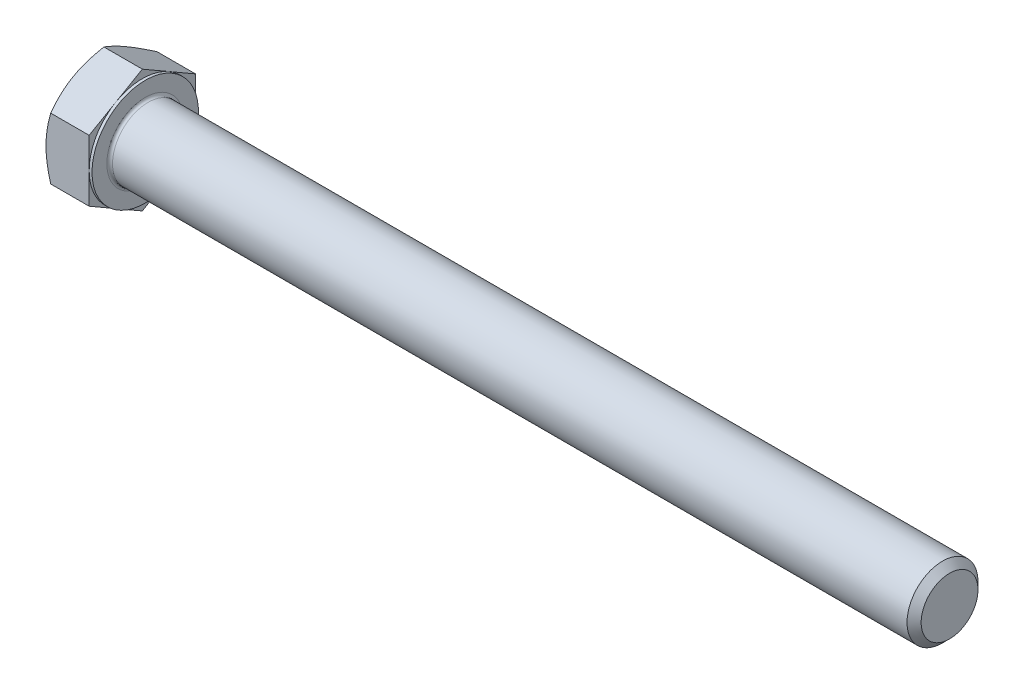
ISO-10303-21;
HEADER;
FILE_DESCRIPTION(('STEP AP214'),'2;1');
FILE_NAME('part.step','',(''),(''),'','','');
FILE_SCHEMA(('AUTOMOTIVE_DESIGN { 1 0 10303 214 1 1 1 1 }'));
ENDSEC;
DATA;
#1=APPLICATION_CONTEXT('core data for automotive mechanical design processes');
#2=APPLICATION_PROTOCOL_DEFINITION('international standard','automotive_design',2000,#1);
#3=PRODUCT_CONTEXT('',#1,'mechanical');
#4=PRODUCT('Part','Part','',(#3));
#5=PRODUCT_RELATED_PRODUCT_CATEGORY('part','',(#4));
#6=PRODUCT_DEFINITION_FORMATION('','',#4);
#7=PRODUCT_DEFINITION_CONTEXT('part definition',#1,'design');
#8=PRODUCT_DEFINITION('design','',#6,#7);
#9=PRODUCT_DEFINITION_SHAPE('','',#8);
#10=(LENGTH_UNIT() NAMED_UNIT(*) SI_UNIT(.MILLI.,.METRE.));
#11=(NAMED_UNIT(*) PLANE_ANGLE_UNIT() SI_UNIT($,.RADIAN.));
#12=(NAMED_UNIT(*) SI_UNIT($,.STERADIAN.) SOLID_ANGLE_UNIT());
#13=UNCERTAINTY_MEASURE_WITH_UNIT(LENGTH_MEASURE(1.E-05),#10,'distance_accuracy_value','');
#14=(GEOMETRIC_REPRESENTATION_CONTEXT(3) GLOBAL_UNCERTAINTY_ASSIGNED_CONTEXT((#13)) GLOBAL_UNIT_ASSIGNED_CONTEXT((#10,
#11,#12)) REPRESENTATION_CONTEXT('',''));
#15=CARTESIAN_POINT('',(0.,0.,0.));
#16=DIRECTION('',(0.,0.,1.));
#17=DIRECTION('',(1.,0.,0.));
#18=AXIS2_PLACEMENT_3D('',#15,#16,#17);
#19=CARTESIAN_POINT('',(0.,8.24155962262808,0.));
#20=DIRECTION('',(1.,0.,0.));
#21=DIRECTION('',(0.,0.,-1.));
#22=AXIS2_PLACEMENT_3D('',#19,#20,#21);
#23=PLANE('',#22);
#24=CARTESIAN_POINT('',(0.,0.,0.));
#25=DIRECTION('',(1.,0.,0.));
#26=DIRECTION('',(0.,0.,-1.));
#27=AXIS2_PLACEMENT_3D('',#24,#25,#26);
#28=CIRCLE('',#27,7.1374);
#29=CARTESIAN_POINT('',(0.,-6.18116971697105,-3.56870000000001));
#30=VERTEX_POINT('',#29);
#31=CARTESIAN_POINT('',(0.,0.,-7.1374));
#32=VERTEX_POINT('',#31);
#33=EDGE_CURVE('E141',#30,#32,#28,.T.);
#34=ORIENTED_EDGE('',*,*,#33,.F.);
#35=CARTESIAN_POINT('',(0.,0.,0.));
#36=DIRECTION('',(1.,0.,0.));
#37=DIRECTION('',(0.,0.,-1.));
#38=AXIS2_PLACEMENT_3D('',#35,#36,#37);
#39=CIRCLE('',#38,7.1374);
#40=CARTESIAN_POINT('',(0.,-6.18116971697106,3.56870000000001));
#41=VERTEX_POINT('',#40);
#42=EDGE_CURVE('E138',#41,#30,#39,.T.);
#43=ORIENTED_EDGE('',*,*,#42,.F.);
#44=CARTESIAN_POINT('',(0.,0.,0.));
#45=DIRECTION('',(1.,0.,0.));
#46=DIRECTION('',(0.,0.,-1.));
#47=AXIS2_PLACEMENT_3D('',#44,#45,#46);
#48=CIRCLE('',#47,7.1374);
#49=CARTESIAN_POINT('',(0.,0.,7.1374));
#50=VERTEX_POINT('',#49);
#51=EDGE_CURVE('E492',#50,#41,#48,.T.);
#52=ORIENTED_EDGE('',*,*,#51,.F.);
#53=CARTESIAN_POINT('',(0.,0.,0.));
#54=DIRECTION('',(1.,0.,0.));
#55=DIRECTION('',(0.,0.,-1.));
#56=AXIS2_PLACEMENT_3D('',#53,#54,#55);
#57=CIRCLE('',#56,7.1374);
#58=CARTESIAN_POINT('',(0.,6.18116971697105,3.56870000000001));
#59=VERTEX_POINT('',#58);
#60=EDGE_CURVE('E207',#59,#50,#57,.T.);
#61=ORIENTED_EDGE('',*,*,#60,.F.);
#62=CARTESIAN_POINT('',(0.,0.,0.));
#63=DIRECTION('',(1.,0.,0.));
#64=DIRECTION('',(0.,0.,-1.));
#65=AXIS2_PLACEMENT_3D('',#62,#63,#64);
#66=CIRCLE('',#65,7.1374);
#67=CARTESIAN_POINT('',(0.,6.18116971697105,-3.56870000000001));
#68=VERTEX_POINT('',#67);
#69=EDGE_CURVE('E498',#68,#59,#66,.T.);
#70=ORIENTED_EDGE('',*,*,#69,.F.);
#71=CARTESIAN_POINT('',(0.,0.,0.));
#72=DIRECTION('',(1.,0.,0.));
#73=DIRECTION('',(0.,0.,-1.));
#74=AXIS2_PLACEMENT_3D('',#71,#72,#73);
#75=CIRCLE('',#74,7.1374);
#76=EDGE_CURVE('E144',#32,#68,#75,.T.);
#77=ORIENTED_EDGE('',*,*,#76,.F.);
#78=EDGE_LOOP('',(#34,#43,#52,#61,#70,#77));
#79=FACE_BOUND('',#78,.T.);
#80=ADVANCED_FACE('F16',(#79),#23,.F.);
#81=CARTESIAN_POINT('',(0.641311776484754,0.,0.));
#82=DIRECTION('',(1.,0.,0.));
#83=DIRECTION('',(0.,0.,-1.));
#84=AXIS2_PLACEMENT_3D('',#81,#82,#83);
#85=CONICAL_SURFACE('',#84,8.24818458036387,1.0471975511966);
#86=ORIENTED_EDGE('',*,*,#42,.T.);
#87=CARTESIAN_POINT('',(0.,-6.18116971697106,-3.56870000000002));
#88=CARTESIAN_POINT('',(-2.91702878281906E-05,-6.26862170985652,-3.41722870509925));
#89=CARTESIAN_POINT('',(0.00371114889844038,-6.35606948988297,-3.26576470708432));
#90=CARTESIAN_POINT('',(0.0185139577467835,-6.53079334497843,-2.9631341127647));
#91=CARTESIAN_POINT('',(0.0295749978503088,-6.61806945060963,-2.81196746352471));
#92=CARTESIAN_POINT('',(0.0587296036169501,-6.7918862225359,-2.5109079833408));
#93=CARTESIAN_POINT('',(0.0767877659737066,-6.87842838481195,-2.3610125612818));
#94=CARTESIAN_POINT('',(0.119548178265526,-7.05110039256495,-2.06193587080869));
#95=CARTESIAN_POINT('',(0.144250603082628,-7.13723022712836,-1.91275462129736));
#96=CARTESIAN_POINT('',(0.227561148311189,-7.39464422393007,-1.46690050025742));
#97=CARTESIAN_POINT('',(0.295412992760169,-7.56518058886256,-1.17152285165624));
#98=CARTESIAN_POINT('',(0.451896700790797,-7.90478678087675,-0.583307672522674));
#99=CARTESIAN_POINT('',(0.540632343376944,-8.07384476218822,-0.290490659466179));
#100=CARTESIAN_POINT('',(0.637486855352638,-8.2415596226281,0.));
#101=B_SPLINE_CURVE_WITH_KNOTS('',3,(#87,#88,#89,#90,#91,#92,#93,#94,#95,#96,#97,#98,#99,#100),
.UNSPECIFIED.,.F.,.F.,(4,2,2,2,2,2,4),(0.,0.524658409500519,1.04921296370403,1.5711473776056,
2.09309553056225,3.13562382142666,4.18344647054619),.UNSPECIFIED.);
#102=CARTESIAN_POINT('',(0.637486855352637,-8.2415596226281,0.));
#103=VERTEX_POINT('',#102);
#104=EDGE_CURVE('E158',#30,#103,#101,.T.);
#105=ORIENTED_EDGE('',*,*,#104,.T.);
#106=CARTESIAN_POINT('',(0.637486855352637,-8.2415596226281,0.));
#107=CARTESIAN_POINT('',(0.540632343376944,-8.07384476218822,0.290490659466181));
#108=CARTESIAN_POINT('',(0.451896700790797,-7.90478678087675,0.583307672522676));
#109=CARTESIAN_POINT('',(0.295412992760169,-7.56518058886257,1.17152285165624));
#110=CARTESIAN_POINT('',(0.227561148311189,-7.39464422393008,1.46690050025742));
#111=CARTESIAN_POINT('',(0.14425060308263,-7.13723022712836,1.91275462129736));
#112=CARTESIAN_POINT('',(0.119548178265528,-7.05110039256495,2.06193587080869));
#113=CARTESIAN_POINT('',(0.0767877659737086,-6.87842838481196,2.3610125612818));
#114=CARTESIAN_POINT('',(0.0587296036169518,-6.7918862225359,2.5109079833408));
#115=CARTESIAN_POINT('',(0.0295749978503104,-6.61806945060963,2.81196746352471));
#116=CARTESIAN_POINT('',(0.0185139577467855,-6.53079334497843,2.9631341127647));
#117=CARTESIAN_POINT('',(0.00371114889844278,-6.35606948988298,3.26576470708432));
#118=CARTESIAN_POINT('',(-2.91702878256121E-05,-6.26862170985652,3.41722870509925));
#119=CARTESIAN_POINT('',(0.,-6.18116971697107,3.56870000000002));
#120=B_SPLINE_CURVE_WITH_KNOTS('',3,(#106,#107,#108,#109,#110,#111,#112,#113,#114,#115,#116,
#117,#118,#119),.UNSPECIFIED.,.F.,.F.,(4,2,2,2,2,2,4),(0.,1.04782264911953,2.09035093998394,
2.61229909294058,3.13423350684215,3.65878806104566,4.18344647054618),.UNSPECIFIED.);
#121=EDGE_CURVE('E164',#103,#41,#120,.T.);
#122=ORIENTED_EDGE('',*,*,#121,.T.);
#123=EDGE_LOOP('',(#86,#105,#122));
#124=FACE_BOUND('',#123,.T.);
#125=ADVANCED_FACE('F162',(#124),#85,.T.);
#126=CARTESIAN_POINT('',(0.641311776484743,0.,0.));
#127=DIRECTION('',(1.,0.,0.));
#128=DIRECTION('',(0.,0.,-1.));
#129=AXIS2_PLACEMENT_3D('',#126,#127,#128);
#130=CONICAL_SURFACE('',#129,8.24818458036385,1.0471975511966);
#131=ORIENTED_EDGE('',*,*,#33,.T.);
#132=CARTESIAN_POINT('',(0.,0.,-7.1374));
#133=CARTESIAN_POINT('',(-2.91702878363875E-05,-0.174903985770917,-7.1374));
#134=CARTESIAN_POINT('',(0.0037111488984321,-0.349799545823828,-7.1374));
#135=CARTESIAN_POINT('',(0.0185139577467752,-0.699247256014727,-7.1374));
#136=CARTESIAN_POINT('',(0.0295749978503004,-0.873799467277128,-7.1374));
#137=CARTESIAN_POINT('',(0.0587296036169417,-1.22143301112966,-7.1374));
#138=CARTESIAN_POINT('',(0.0767877659736981,-1.39451733568178,-7.1374));
#139=CARTESIAN_POINT('',(0.119548178265518,-1.73986135118776,-7.1374));
#140=CARTESIAN_POINT('',(0.144250603082619,-1.91212102031459,-7.1374));
#141=CARTESIAN_POINT('',(0.227561148311179,-2.42694901391801,-7.1374));
#142=CARTESIAN_POINT('',(0.295412992760159,-2.76802174378299,-7.1374));
#143=CARTESIAN_POINT('',(0.451896700790786,-3.44723412781136,-7.1374));
#144=CARTESIAN_POINT('',(0.540632343376933,-3.7853500904343,-7.1374));
#145=CARTESIAN_POINT('',(0.637486855352627,-4.12077981131404,-7.1374));
#146=B_SPLINE_CURVE_WITH_KNOTS('',3,(#132,#133,#134,#135,#136,#137,#138,#139,#140,#141,#142,
#143,#144,#145),.UNSPECIFIED.,.F.,.F.,(4,2,2,2,2,2,4),(0.,0.524658409500517,1.04921296370403,
1.5711473776056,2.09309553056224,3.13562382142665,4.18344647054617),.UNSPECIFIED.);
#147=CARTESIAN_POINT('',(0.637486855352626,-4.12077981131404,-7.1374));
#148=VERTEX_POINT('',#147);
#149=EDGE_CURVE('E153',#32,#148,#146,.T.);
#150=ORIENTED_EDGE('',*,*,#149,.T.);
#151=CARTESIAN_POINT('',(0.637486855352626,-4.12077981131404,-7.1374));
#152=CARTESIAN_POINT('',(0.540632343376933,-4.28849467175391,-6.84690934053382));
#153=CARTESIAN_POINT('',(0.451896700790788,-4.45755265306538,-6.55409232747733));
#154=CARTESIAN_POINT('',(0.295412992760162,-4.79715884507957,-5.96587714834377));
#155=CARTESIAN_POINT('',(0.227561148311183,-4.96769521001206,-5.6704994997426));
#156=CARTESIAN_POINT('',(0.144250603082625,-5.22510920681377,-5.22464537870266));
#157=CARTESIAN_POINT('',(0.119548178265524,-5.31123904137718,-5.07546412919133));
#158=CARTESIAN_POINT('',(0.076787765973705,-5.48391104913017,-4.77638743871822));
#159=CARTESIAN_POINT('',(0.0587296036169484,-5.57045321140623,-4.62649201665922));
#160=CARTESIAN_POINT('',(0.0295749978503076,-5.7442699833325,-4.32543253647532));
#161=CARTESIAN_POINT('',(0.0185139577467831,-5.8315460889637,-4.17426588723533));
#162=CARTESIAN_POINT('',(0.00371114889844091,-6.00626994405915,-3.87163529291571));
#163=CARTESIAN_POINT('',(-2.91702878274496E-05,-6.0937177240856,-3.72017129490078));
#164=CARTESIAN_POINT('',(0.,-6.18116971697106,-3.56870000000002));
#165=B_SPLINE_CURVE_WITH_KNOTS('',3,(#151,#152,#153,#154,#155,#156,#157,#158,#159,#160,#161,
#162,#163,#164),.UNSPECIFIED.,.F.,.F.,(4,2,2,2,2,2,4),(0.,1.04782264911952,2.09035093998392,
2.61229909294056,3.13423350684212,3.65878806104563,4.18344647054614),.UNSPECIFIED.);
#166=EDGE_CURVE('E151',#148,#30,#165,.T.);
#167=ORIENTED_EDGE('',*,*,#166,.T.);
#168=EDGE_LOOP('',(#131,#150,#167));
#169=FACE_BOUND('',#168,.T.);
#170=ADVANCED_FACE('F152',(#169),#130,.T.);
#171=CARTESIAN_POINT('',(0.641311776484739,0.,0.));
#172=DIRECTION('',(1.,0.,0.));
#173=DIRECTION('',(0.,0.,-1.));
#174=AXIS2_PLACEMENT_3D('',#171,#172,#173);
#175=CONICAL_SURFACE('',#174,8.24818458036384,1.0471975511966);
#176=CARTESIAN_POINT('',(0.637486855352624,4.12077981131404,-7.1374));
#177=CARTESIAN_POINT('',(0.540632343376931,3.78535009043429,-7.1374));
#178=CARTESIAN_POINT('',(0.451896700790785,3.44723412781136,-7.1374));
#179=CARTESIAN_POINT('',(0.295412992760157,2.76802174378299,-7.1374));
#180=CARTESIAN_POINT('',(0.227561148311177,2.42694901391801,-7.1374));
#181=CARTESIAN_POINT('',(0.144250603082619,1.91212102031458,-7.1374));
#182=CARTESIAN_POINT('',(0.119548178265517,1.73986135118776,-7.1374));
#183=CARTESIAN_POINT('',(0.076787765973698,1.39451733568178,-7.1374));
#184=CARTESIAN_POINT('',(0.0587296036169412,1.22143301112966,-7.1374));
#185=CARTESIAN_POINT('',(0.0295749978502998,0.873799467277126,-7.1374));
#186=CARTESIAN_POINT('',(0.018513957746775,0.699247256014726,-7.1374));
#187=CARTESIAN_POINT('',(0.0037111488984325,0.349799545823827,-7.1374));
#188=CARTESIAN_POINT('',(-2.91702878357943E-05,0.174903985770916,-7.1374));
#189=CARTESIAN_POINT('',(0.,0.,-7.1374));
#190=B_SPLINE_CURVE_WITH_KNOTS('',3,(#176,#177,#178,#179,#180,#181,#182,#183,#184,#185,#186,
#187,#188,#189),.UNSPECIFIED.,.F.,.F.,(4,2,2,2,2,2,4),(0.,1.04782264911952,2.09035093998393,
2.61229909294057,3.13423350684214,3.65878806104565,4.18344647054616),.UNSPECIFIED.);
#191=CARTESIAN_POINT('',(0.637486855352624,4.12077981131404,-7.1374));
#192=VERTEX_POINT('',#191);
#193=EDGE_CURVE('E177',#192,#32,#190,.T.);
#194=ORIENTED_EDGE('',*,*,#193,.T.);
#195=ORIENTED_EDGE('',*,*,#76,.T.);
#196=CARTESIAN_POINT('',(0.,6.18116971697105,-3.56870000000001));
#197=CARTESIAN_POINT('',(-2.9170287832926E-05,6.0937177240856,-3.72017129490077));
#198=CARTESIAN_POINT('',(0.00371114889843545,6.00626994405914,-3.8716352929157));
#199=CARTESIAN_POINT('',(0.018513957746778,5.83154608896369,-4.17426588723532));
#200=CARTESIAN_POINT('',(0.0295749978503029,5.74426998333249,-4.32543253647531));
#201=CARTESIAN_POINT('',(0.0587296036169437,5.57045321140622,-4.62649201665922));
#202=CARTESIAN_POINT('',(0.0767877659737001,5.48391104913017,-4.77638743871822));
#203=CARTESIAN_POINT('',(0.119548178265519,5.31123904137718,-5.07546412919132));
#204=CARTESIAN_POINT('',(0.144250603082621,5.22510920681376,-5.22464537870265));
#205=CARTESIAN_POINT('',(0.22756114831118,4.96769521001205,-5.67049949974259));
#206=CARTESIAN_POINT('',(0.295412992760159,4.79715884507956,-5.96587714834377));
#207=CARTESIAN_POINT('',(0.451896700790785,4.45755265306538,-6.55409232747733));
#208=CARTESIAN_POINT('',(0.540632343376931,4.28849467175391,-6.84690934053382));
#209=CARTESIAN_POINT('',(0.637486855352624,4.12077981131404,-7.1374));
#210=B_SPLINE_CURVE_WITH_KNOTS('',3,(#196,#197,#198,#199,#200,#201,#202,#203,#204,#205,#206,
#207,#208,#209),.UNSPECIFIED.,.F.,.F.,(4,2,2,2,2,2,4),(0.,0.524658409500515,1.04921296370402,
1.57114737760559,2.09309553056223,3.13562382142663,4.18344647054615),.UNSPECIFIED.);
#211=EDGE_CURVE('E287',#68,#192,#210,.T.);
#212=ORIENTED_EDGE('',*,*,#211,.T.);
#213=EDGE_LOOP('',(#194,#195,#212));
#214=FACE_BOUND('',#213,.T.);
#215=ADVANCED_FACE('F276',(#214),#175,.T.);
#216=CARTESIAN_POINT('',(0.641311776484745,0.,0.));
#217=DIRECTION('',(1.,0.,0.));
#218=DIRECTION('',(0.,0.,-1.));
#219=AXIS2_PLACEMENT_3D('',#216,#217,#218);
#220=CONICAL_SURFACE('',#219,8.24818458036385,1.0471975511966);
#221=CARTESIAN_POINT('',(0.637486855352629,8.24155962262808,0.));
#222=CARTESIAN_POINT('',(0.540632343376936,8.07384476218821,-0.290490659466181));
#223=CARTESIAN_POINT('',(0.45189670079079,7.90478678087674,-0.583307672522675));
#224=CARTESIAN_POINT('',(0.295412992760162,7.56518058886255,-1.17152285165624));
#225=CARTESIAN_POINT('',(0.227561148311182,7.39464422393006,-1.46690050025742));
#226=CARTESIAN_POINT('',(0.144250603082622,7.13723022712835,-1.91275462129736));
#227=CARTESIAN_POINT('',(0.119548178265521,7.05110039256494,-2.06193587080869));
#228=CARTESIAN_POINT('',(0.076787765973701,6.87842838481194,-2.3610125612818));
#229=CARTESIAN_POINT('',(0.0587296036169442,6.79188622253589,-2.5109079833408));
#230=CARTESIAN_POINT('',(0.0295749978503029,6.61806945060962,-2.81196746352471));
#231=CARTESIAN_POINT('',(0.018513957746778,6.53079334497842,-2.96313411276469));
#232=CARTESIAN_POINT('',(0.00371114889843529,6.35606948988297,-3.26576470708432));
#233=CARTESIAN_POINT('',(-2.91702878331806E-05,6.26862170985651,-3.41722870509924));
#234=CARTESIAN_POINT('',(0.,6.18116971697105,-3.56870000000001));
#235=B_SPLINE_CURVE_WITH_KNOTS('',3,(#221,#222,#223,#224,#225,#226,#227,#228,#229,#230,#231,
#232,#233,#234),.UNSPECIFIED.,.F.,.F.,(4,2,2,2,2,2,4),(0.,1.04782264911952,2.09035093998393,
2.61229909294058,3.13423350684215,3.65878806104566,4.18344647054617),.UNSPECIFIED.);
#236=CARTESIAN_POINT('',(0.637486855352629,8.24155962262808,0.));
#237=VERTEX_POINT('',#236);
#238=EDGE_CURVE('E281',#237,#68,#235,.T.);
#239=ORIENTED_EDGE('',*,*,#238,.T.);
#240=ORIENTED_EDGE('',*,*,#69,.T.);
#241=CARTESIAN_POINT('',(0.,6.18116971697105,3.56870000000001));
#242=CARTESIAN_POINT('',(-2.9170287834756E-05,6.26862170985651,3.41722870509925));
#243=CARTESIAN_POINT('',(0.00371114889843365,6.35606948988296,3.26576470708432));
#244=CARTESIAN_POINT('',(0.018513957746776,6.53079334497841,2.9631341127647));
#245=CARTESIAN_POINT('',(0.0295749978503007,6.61806945060961,2.81196746352471));
#246=CARTESIAN_POINT('',(0.0587296036169419,6.79188622253588,2.5109079833408));
#247=CARTESIAN_POINT('',(0.0767877659736988,6.87842838481194,2.3610125612818));
#248=CARTESIAN_POINT('',(0.119548178265519,7.05110039256493,2.06193587080869));
#249=CARTESIAN_POINT('',(0.14425060308262,7.13723022712835,1.91275462129736));
#250=CARTESIAN_POINT('',(0.22756114831118,7.39464422393006,1.46690050025742));
#251=CARTESIAN_POINT('',(0.295412992760161,7.56518058886255,1.17152285165624));
#252=CARTESIAN_POINT('',(0.451896700790789,7.90478678087674,0.583307672522675));
#253=CARTESIAN_POINT('',(0.540632343376935,8.07384476218821,0.29049065946618));
#254=CARTESIAN_POINT('',(0.637486855352629,8.24155962262808,0.));
#255=B_SPLINE_CURVE_WITH_KNOTS('',3,(#241,#242,#243,#244,#245,#246,#247,#248,#249,#250,#251,
#252,#253,#254),.UNSPECIFIED.,.F.,.F.,(4,2,2,2,2,2,4),(0.,0.524658409500518,1.04921296370403,
1.5711473776056,2.09309553056224,3.13562382142665,4.18344647054618),.UNSPECIFIED.);
#256=EDGE_CURVE('E267',#59,#237,#255,.T.);
#257=ORIENTED_EDGE('',*,*,#256,.T.);
#258=EDGE_LOOP('',(#239,#240,#257));
#259=FACE_BOUND('',#258,.T.);
#260=ADVANCED_FACE('F273',(#259),#220,.T.);
#261=CARTESIAN_POINT('',(0.641311776484745,0.,0.));
#262=DIRECTION('',(1.,0.,0.));
#263=DIRECTION('',(0.,0.,-1.));
#264=AXIS2_PLACEMENT_3D('',#261,#262,#263);
#265=CONICAL_SURFACE('',#264,8.24818458036385,1.0471975511966);
#266=ORIENTED_EDGE('',*,*,#51,.T.);
#267=CARTESIAN_POINT('',(0.,-6.18116971697107,3.56870000000002));
#268=CARTESIAN_POINT('',(-2.9170287825595E-05,-6.09371772408561,3.72017129490078));
#269=CARTESIAN_POINT('',(0.00371114889844298,-6.00626994405915,3.87163529291571));
#270=CARTESIAN_POINT('',(0.0185139577467859,-5.8315460889637,4.17426588723533));
#271=CARTESIAN_POINT('',(0.0295749978503109,-5.7442699833325,4.32543253647531));
#272=CARTESIAN_POINT('',(0.0587296036169516,-5.57045321140624,4.62649201665922));
#273=CARTESIAN_POINT('',(0.0767877659737078,-5.48391104913018,4.77638743871822));
#274=CARTESIAN_POINT('',(0.119548178265527,-5.31123904137719,5.07546412919133));
#275=CARTESIAN_POINT('',(0.144250603082628,-5.22510920681378,5.22464537870266));
#276=CARTESIAN_POINT('',(0.227561148311187,-4.96769521001206,5.6704994997426));
#277=CARTESIAN_POINT('',(0.295412992760166,-4.79715884507958,5.96587714834377));
#278=CARTESIAN_POINT('',(0.451896700790791,-4.45755265306539,6.55409232747733));
#279=CARTESIAN_POINT('',(0.540632343376936,-4.28849467175392,6.84690934053382));
#280=CARTESIAN_POINT('',(0.637486855352629,-4.12077981131405,7.1374));
#281=B_SPLINE_CURVE_WITH_KNOTS('',3,(#267,#268,#269,#270,#271,#272,#273,#274,#275,#276,#277,
#278,#279,#280),.UNSPECIFIED.,.F.,.F.,(4,2,2,2,2,2,4),(0.,0.524658409500513,1.04921296370402,
1.57114737760559,2.09309553056223,3.13562382142663,4.18344647054615),.UNSPECIFIED.);
#282=CARTESIAN_POINT('',(0.637486855352629,-4.12077981131405,7.1374));
#283=VERTEX_POINT('',#282);
#284=EDGE_CURVE('E159',#41,#283,#281,.T.);
#285=ORIENTED_EDGE('',*,*,#284,.T.);
#286=CARTESIAN_POINT('',(0.637486855352629,-4.12077981131405,7.1374));
#287=CARTESIAN_POINT('',(0.540632343376935,-3.78535009043431,7.1374));
#288=CARTESIAN_POINT('',(0.451896700790788,-3.44723412781137,7.1374));
#289=CARTESIAN_POINT('',(0.29541299276016,-2.768021743783,7.1374));
#290=CARTESIAN_POINT('',(0.22756114831118,-2.42694901391802,7.1374));
#291=CARTESIAN_POINT('',(0.14425060308262,-1.91212102031459,7.1374));
#292=CARTESIAN_POINT('',(0.119548178265519,-1.73986135118776,7.1374));
#293=CARTESIAN_POINT('',(0.0767877659736989,-1.39451733568178,7.1374));
#294=CARTESIAN_POINT('',(0.0587296036169421,-1.22143301112967,7.1374));
#295=CARTESIAN_POINT('',(0.0295749978503008,-0.87379946727713,7.1374));
#296=CARTESIAN_POINT('',(0.018513957746776,-0.699247256014728,7.1374));
#297=CARTESIAN_POINT('',(0.00371114889843334,-0.349799545823828,7.1374));
#298=CARTESIAN_POINT('',(-2.91702878350887E-05,-0.174903985770916,7.1374));
#299=CARTESIAN_POINT('',(0.,0.,7.1374));
#300=B_SPLINE_CURVE_WITH_KNOTS('',3,(#286,#287,#288,#289,#290,#291,#292,#293,#294,#295,#296,
#297,#298,#299),.UNSPECIFIED.,.F.,.F.,(4,2,2,2,2,2,4),(0.,1.04782264911953,2.09035093998394,
2.61229909294058,3.13423350684215,3.65878806104566,4.18344647054618),.UNSPECIFIED.);
#301=EDGE_CURVE('E245',#283,#50,#300,.T.);
#302=ORIENTED_EDGE('',*,*,#301,.T.);
#303=EDGE_LOOP('',(#266,#285,#302));
#304=FACE_BOUND('',#303,.T.);
#305=ADVANCED_FACE('F222',(#304),#265,.T.);
#306=CARTESIAN_POINT('',(0.641311776484738,0.,0.));
#307=DIRECTION('',(1.,0.,0.));
#308=DIRECTION('',(0.,0.,-1.));
#309=AXIS2_PLACEMENT_3D('',#306,#307,#308);
#310=CONICAL_SURFACE('',#309,8.24818458036384,1.0471975511966);
#311=CARTESIAN_POINT('',(0.637486855352622,4.12077981131403,7.1374));
#312=CARTESIAN_POINT('',(0.540632343376929,4.2884946717539,6.84690934053382));
#313=CARTESIAN_POINT('',(0.451896700790783,4.45755265306537,6.55409232747733));
#314=CARTESIAN_POINT('',(0.295412992760157,4.79715884507955,5.96587714834377));
#315=CARTESIAN_POINT('',(0.227561148311178,4.96769521001204,5.67049949974259));
#316=CARTESIAN_POINT('',(0.144250603082619,5.22510920681376,5.22464537870266));
#317=CARTESIAN_POINT('',(0.119548178265518,5.31123904137717,5.07546412919132));
#318=CARTESIAN_POINT('',(0.0767877659736985,5.48391104913016,4.77638743871822));
#319=CARTESIAN_POINT('',(0.0587296036169418,5.57045321140622,4.62649201665922));
#320=CARTESIAN_POINT('',(0.0295749978503007,5.74426998333248,4.32543253647531));
#321=CARTESIAN_POINT('',(0.0185139577467759,5.83154608896368,4.17426588723532));
#322=CARTESIAN_POINT('',(0.00371114889843337,6.00626994405913,3.8716352929157));
#323=CARTESIAN_POINT('',(-2.91702878350612E-05,6.09371772408559,3.72017129490078));
#324=CARTESIAN_POINT('',(0.,6.18116971697105,3.56870000000001));
#325=B_SPLINE_CURVE_WITH_KNOTS('',3,(#311,#312,#313,#314,#315,#316,#317,#318,#319,#320,#321,
#322,#323,#324),.UNSPECIFIED.,.F.,.F.,(4,2,2,2,2,2,4),(0.,1.04782264911952,2.09035093998392,
2.61229909294056,3.13423350684213,3.65878806104564,4.18344647054615),.UNSPECIFIED.);
#326=CARTESIAN_POINT('',(0.637486855352622,4.12077981131403,7.1374));
#327=VERTEX_POINT('',#326);
#328=EDGE_CURVE('E228',#327,#59,#325,.T.);
#329=ORIENTED_EDGE('',*,*,#328,.T.);
#330=ORIENTED_EDGE('',*,*,#60,.T.);
#331=CARTESIAN_POINT('',(0.,0.,7.1374));
#332=CARTESIAN_POINT('',(-2.91702878350349E-05,0.174903985770917,7.1374));
#333=CARTESIAN_POINT('',(0.00371114889843339,0.349799545823827,7.1374));
#334=CARTESIAN_POINT('',(0.0185139577467758,0.699247256014725,7.1374));
#335=CARTESIAN_POINT('',(0.0295749978503005,0.873799467277125,7.1374));
#336=CARTESIAN_POINT('',(0.0587296036169414,1.22143301112966,7.1374));
#337=CARTESIAN_POINT('',(0.076787765973698,1.39451733568177,7.1374));
#338=CARTESIAN_POINT('',(0.119548178265517,1.73986135118775,7.1374));
#339=CARTESIAN_POINT('',(0.144250603082619,1.91212102031458,7.1374));
#340=CARTESIAN_POINT('',(0.227561148311177,2.426949013918,7.1374));
#341=CARTESIAN_POINT('',(0.295412992760157,2.76802174378298,7.1374));
#342=CARTESIAN_POINT('',(0.451896700790783,3.44723412781135,7.1374));
#343=CARTESIAN_POINT('',(0.540632343376929,3.78535009043429,7.1374));
#344=CARTESIAN_POINT('',(0.637486855352622,4.12077981131403,7.1374));
#345=B_SPLINE_CURVE_WITH_KNOTS('',3,(#331,#332,#333,#334,#335,#336,#337,#338,#339,#340,#341,
#342,#343,#344),.UNSPECIFIED.,.F.,.F.,(4,2,2,2,2,2,4),(0.,0.524658409500515,1.04921296370402,
1.57114737760559,2.09309553056223,3.13562382142663,4.18344647054615),.UNSPECIFIED.);
#346=EDGE_CURVE('E236',#50,#327,#345,.T.);
#347=ORIENTED_EDGE('',*,*,#346,.T.);
#348=EDGE_LOOP('',(#329,#330,#347));
#349=FACE_BOUND('',#348,.T.);
#350=ADVANCED_FACE('F217',(#349),#310,.T.);
#351=CARTESIAN_POINT('',(6.1722,-8.2415596226281,0.));
#352=DIRECTION('',(0.,0.866025403784438,-0.500000000000001));
#353=DIRECTION('',(0.,0.500000000000001,0.866025403784438));
#354=AXIS2_PLACEMENT_3D('',#351,#352,#353);
#355=PLANE('',#354);
#356=DIRECTION('',(-1.,0.,0.));
#357=VECTOR('',#356,1.);
#358=CARTESIAN_POINT('',(6.1722,-4.12077981131405,7.1374));
#359=LINE('',#358,#357);
#360=CARTESIAN_POINT('',(5.7912,-4.12077981131405,7.1374));
#361=VERTEX_POINT('',#360);
#362=EDGE_CURVE('E411',#361,#283,#359,.T.);
#363=ORIENTED_EDGE('',*,*,#362,.T.);
#364=ORIENTED_EDGE('',*,*,#284,.F.);
#365=ORIENTED_EDGE('',*,*,#121,.F.);
#366=DIRECTION('',(1.,0.,0.));
#367=VECTOR('',#366,1.);
#368=CARTESIAN_POINT('',(6.1722,-8.2415596226281,0.));
#369=LINE('',#368,#367);
#370=CARTESIAN_POINT('',(5.7912,-8.2415596226281,0.));
#371=VERTEX_POINT('',#370);
#372=EDGE_CURVE('E171',#103,#371,#369,.T.);
#373=ORIENTED_EDGE('',*,*,#372,.T.);
#374=DIRECTION('',(0.,-0.500000000000005,-0.866025403784436));
#375=VECTOR('',#374,1.);
#376=CARTESIAN_POINT('',(5.7912,-6.18116971697105,3.5687));
#377=LINE('',#376,#375);
#378=CARTESIAN_POINT('',(5.7912,-6.18116971697105,3.5687));
#379=VERTEX_POINT('',#378);
#380=EDGE_CURVE('E397',#379,#371,#377,.T.);
#381=ORIENTED_EDGE('',*,*,#380,.F.);
#382=DIRECTION('',(0.,-0.499999999999996,-0.866025403784441));
#383=VECTOR('',#382,1.);
#384=CARTESIAN_POINT('',(5.7912,-4.12077981131405,7.1374));
#385=LINE('',#384,#383);
#386=EDGE_CURVE('E401',#361,#379,#385,.T.);
#387=ORIENTED_EDGE('',*,*,#386,.F.);
#388=EDGE_LOOP('',(#363,#364,#365,#373,#381,#387));
#389=FACE_BOUND('',#388,.T.);
#390=ADVANCED_FACE('F213',(#389),#355,.F.);
#391=CARTESIAN_POINT('',(6.1722,-4.12077981131404,-7.1374));
#392=DIRECTION('',(0.,0.866025403784438,0.500000000000001));
#393=DIRECTION('',(0.,-0.500000000000001,0.866025403784438));
#394=AXIS2_PLACEMENT_3D('',#391,#392,#393);
#395=PLANE('',#394);
#396=ORIENTED_EDGE('',*,*,#372,.F.);
#397=ORIENTED_EDGE('',*,*,#104,.F.);
#398=ORIENTED_EDGE('',*,*,#166,.F.);
#399=DIRECTION('',(1.,0.,0.));
#400=VECTOR('',#399,1.);
#401=CARTESIAN_POINT('',(6.1722,-4.12077981131404,-7.1374));
#402=LINE('',#401,#400);
#403=CARTESIAN_POINT('',(5.7912,-4.12077981131404,-7.1374));
#404=VERTEX_POINT('',#403);
#405=EDGE_CURVE('E288',#148,#404,#402,.T.);
#406=ORIENTED_EDGE('',*,*,#405,.T.);
#407=DIRECTION('',(0.,0.499999999999998,-0.866025403784439));
#408=VECTOR('',#407,1.);
#409=CARTESIAN_POINT('',(5.7912,-6.18116971697105,-3.56870000000001));
#410=LINE('',#409,#408);
#411=CARTESIAN_POINT('',(5.7912,-6.18116971697104,-3.56870000000001));
#412=VERTEX_POINT('',#411);
#413=EDGE_CURVE('E390',#412,#404,#410,.T.);
#414=ORIENTED_EDGE('',*,*,#413,.F.);
#415=DIRECTION('',(0.,0.500000000000005,-0.866025403784436));
#416=VECTOR('',#415,1.);
#417=CARTESIAN_POINT('',(5.7912,-8.2415596226281,0.));
#418=LINE('',#417,#416);
#419=EDGE_CURVE('E394',#371,#412,#418,.T.);
#420=ORIENTED_EDGE('',*,*,#419,.F.);
#421=EDGE_LOOP('',(#396,#397,#398,#406,#414,#420));
#422=FACE_BOUND('',#421,.T.);
#423=ADVANCED_FACE('F169',(#422),#395,.F.);
#424=CARTESIAN_POINT('',(6.1722,4.12077981131404,-7.1374));
#425=DIRECTION('',(0.,0.,1.));
#426=DIRECTION('',(0.,-1.,0.));
#427=AXIS2_PLACEMENT_3D('',#424,#425,#426);
#428=PLANE('',#427);
#429=ORIENTED_EDGE('',*,*,#405,.F.);
#430=ORIENTED_EDGE('',*,*,#149,.F.);
#431=ORIENTED_EDGE('',*,*,#193,.F.);
#432=DIRECTION('',(1.,0.,0.));
#433=VECTOR('',#432,1.);
#434=CARTESIAN_POINT('',(6.1722,4.12077981131404,-7.1374));
#435=LINE('',#434,#433);
#436=CARTESIAN_POINT('',(5.7912,4.12077981131404,-7.1374));
#437=VERTEX_POINT('',#436);
#438=EDGE_CURVE('E417',#192,#437,#435,.T.);
#439=ORIENTED_EDGE('',*,*,#438,.T.);
#440=DIRECTION('',(0.,1.,0.));
#441=VECTOR('',#440,1.);
#442=CARTESIAN_POINT('',(5.7912,7.1374,-7.1374));
#443=LINE('',#442,#441);
#444=CARTESIAN_POINT('',(5.7912,0.,-7.1374));
#445=VERTEX_POINT('',#444);
#446=EDGE_CURVE('E378',#445,#437,#443,.T.);
#447=ORIENTED_EDGE('',*,*,#446,.F.);
#448=DIRECTION('',(0.,1.,0.));
#449=VECTOR('',#448,1.);
#450=CARTESIAN_POINT('',(5.7912,7.1374,-7.1374));
#451=LINE('',#450,#449);
#452=EDGE_CURVE('E386',#404,#445,#451,.T.);
#453=ORIENTED_EDGE('',*,*,#452,.F.);
#454=EDGE_LOOP('',(#429,#430,#431,#439,#447,#453));
#455=FACE_BOUND('',#454,.T.);
#456=ADVANCED_FACE('F296',(#455),#428,.F.);
#457=CARTESIAN_POINT('',(6.1722,4.12077981131404,-7.1374));
#458=DIRECTION('',(0.,-0.866025403784438,0.500000000000001));
#459=DIRECTION('',(0.,-0.500000000000001,-0.866025403784438));
#460=AXIS2_PLACEMENT_3D('',#457,#458,#459);
#461=PLANE('',#460);
#462=ORIENTED_EDGE('',*,*,#438,.F.);
#463=ORIENTED_EDGE('',*,*,#211,.F.);
#464=ORIENTED_EDGE('',*,*,#238,.F.);
#465=DIRECTION('',(1.,0.,0.));
#466=VECTOR('',#465,1.);
#467=CARTESIAN_POINT('',(6.1722,8.24155962262808,0.));
#468=LINE('',#467,#466);
#469=CARTESIAN_POINT('',(5.7912,8.24155962262808,0.));
#470=VERTEX_POINT('',#469);
#471=EDGE_CURVE('E272',#237,#470,#468,.T.);
#472=ORIENTED_EDGE('',*,*,#471,.T.);
#473=DIRECTION('',(0.,0.500000000000002,0.866025403784437));
#474=VECTOR('',#473,1.);
#475=CARTESIAN_POINT('',(5.7912,6.18116971697105,-3.56870000000001));
#476=LINE('',#475,#474);
#477=CARTESIAN_POINT('',(5.7912,6.18116971697105,-3.5687));
#478=VERTEX_POINT('',#477);
#479=EDGE_CURVE('E374',#478,#470,#476,.T.);
#480=ORIENTED_EDGE('',*,*,#479,.F.);
#481=DIRECTION('',(0.,0.5,0.866025403784439));
#482=VECTOR('',#481,1.);
#483=CARTESIAN_POINT('',(5.7912,4.12077981131404,-7.1374));
#484=LINE('',#483,#482);
#485=EDGE_CURVE('E382',#437,#478,#484,.T.);
#486=ORIENTED_EDGE('',*,*,#485,.F.);
#487=EDGE_LOOP('',(#462,#463,#464,#472,#480,#486));
#488=FACE_BOUND('',#487,.T.);
#489=ADVANCED_FACE('F263',(#488),#461,.F.);
#490=CARTESIAN_POINT('',(6.1722,8.24155962262808,0.));
#491=DIRECTION('',(0.,-0.866025403784438,-0.500000000000001));
#492=DIRECTION('',(0.,0.500000000000001,-0.866025403784438));
#493=AXIS2_PLACEMENT_3D('',#490,#491,#492);
#494=PLANE('',#493);
#495=ORIENTED_EDGE('',*,*,#471,.F.);
#496=ORIENTED_EDGE('',*,*,#256,.F.);
#497=ORIENTED_EDGE('',*,*,#328,.F.);
#498=DIRECTION('',(-1.,0.,0.));
#499=VECTOR('',#498,1.);
#500=CARTESIAN_POINT('',(6.1722,4.12077981131403,7.1374));
#501=LINE('',#500,#499);
#502=CARTESIAN_POINT('',(5.7912,4.12077981131403,7.1374));
#503=VERTEX_POINT('',#502);
#504=EDGE_CURVE('E244',#327,#503,#501,.F.);
#505=ORIENTED_EDGE('',*,*,#504,.T.);
#506=DIRECTION('',(0.,-0.500000000000001,0.866025403784438));
#507=VECTOR('',#506,1.);
#508=CARTESIAN_POINT('',(5.7912,6.18116971697105,3.56870000000001));
#509=LINE('',#508,#507);
#510=CARTESIAN_POINT('',(5.7912,6.18116971697104,3.56870000000001));
#511=VERTEX_POINT('',#510);
#512=EDGE_CURVE('E366',#511,#503,#509,.T.);
#513=ORIENTED_EDGE('',*,*,#512,.F.);
#514=DIRECTION('',(0.,-0.500000000000002,0.866025403784438));
#515=VECTOR('',#514,1.);
#516=CARTESIAN_POINT('',(5.7912,8.24155962262808,0.));
#517=LINE('',#516,#515);
#518=EDGE_CURVE('E370',#470,#511,#517,.T.);
#519=ORIENTED_EDGE('',*,*,#518,.F.);
#520=EDGE_LOOP('',(#495,#496,#497,#505,#513,#519));
#521=FACE_BOUND('',#520,.T.);
#522=ADVANCED_FACE('F256',(#521),#494,.F.);
#523=CARTESIAN_POINT('',(6.1722,4.12077981131403,7.1374));
#524=DIRECTION('',(0.,0.,-1.));
#525=DIRECTION('',(-1.,0.,0.));
#526=AXIS2_PLACEMENT_3D('',#523,#524,#525);
#527=PLANE('',#526);
#528=ORIENTED_EDGE('',*,*,#504,.F.);
#529=ORIENTED_EDGE('',*,*,#346,.F.);
#530=ORIENTED_EDGE('',*,*,#301,.F.);
#531=ORIENTED_EDGE('',*,*,#362,.F.);
#532=DIRECTION('',(0.,1.,0.));
#533=VECTOR('',#532,1.);
#534=CARTESIAN_POINT('',(5.7912,7.1374,7.1374));
#535=LINE('',#534,#533);
#536=CARTESIAN_POINT('',(5.7912,0.,7.1374));
#537=VERTEX_POINT('',#536);
#538=EDGE_CURVE('E405',#537,#361,#535,.F.);
#539=ORIENTED_EDGE('',*,*,#538,.F.);
#540=DIRECTION('',(0.,1.,0.));
#541=VECTOR('',#540,1.);
#542=CARTESIAN_POINT('',(5.7912,7.1374,7.1374));
#543=LINE('',#542,#541);
#544=EDGE_CURVE('E357',#503,#537,#543,.F.);
#545=ORIENTED_EDGE('',*,*,#544,.F.);
#546=EDGE_LOOP('',(#528,#529,#530,#531,#539,#545));
#547=FACE_BOUND('',#546,.T.);
#548=ADVANCED_FACE('F251',(#547),#527,.F.);
#549=CARTESIAN_POINT('',(5.7912,7.1374,0.));
#550=DIRECTION('',(1.,0.,0.));
#551=DIRECTION('',(0.,0.,-1.));
#552=AXIS2_PLACEMENT_3D('',#549,#550,#551);
#553=PLANE('',#552);
#554=ORIENTED_EDGE('',*,*,#386,.T.);
#555=CARTESIAN_POINT('',(5.7912,0.,0.));
#556=DIRECTION('',(-1.,0.,0.));
#557=DIRECTION('',(0.,0.,1.));
#558=AXIS2_PLACEMENT_3D('',#555,#556,#557);
#559=CIRCLE('',#558,7.1374);
#560=EDGE_CURVE('E246',#537,#379,#559,.F.);
#561=ORIENTED_EDGE('',*,*,#560,.F.);
#562=ORIENTED_EDGE('',*,*,#538,.T.);
#563=EDGE_LOOP('',(#554,#561,#562));
#564=FACE_BOUND('',#563,.T.);
#565=ADVANCED_FACE('F255',(#564),#553,.T.);
#566=CARTESIAN_POINT('',(5.7912,7.1374,0.));
#567=DIRECTION('',(1.,0.,0.));
#568=DIRECTION('',(0.,0.,-1.));
#569=AXIS2_PLACEMENT_3D('',#566,#567,#568);
#570=PLANE('',#569);
#571=ORIENTED_EDGE('',*,*,#419,.T.);
#572=CARTESIAN_POINT('',(5.7912,0.,0.));
#573=DIRECTION('',(-1.,0.,0.));
#574=DIRECTION('',(0.,0.,1.));
#575=AXIS2_PLACEMENT_3D('',#572,#573,#574);
#576=CIRCLE('',#575,7.1374);
#577=EDGE_CURVE('E445',#379,#412,#576,.F.);
#578=ORIENTED_EDGE('',*,*,#577,.F.);
#579=ORIENTED_EDGE('',*,*,#380,.T.);
#580=EDGE_LOOP('',(#571,#578,#579));
#581=FACE_BOUND('',#580,.T.);
#582=ADVANCED_FACE('F468',(#581),#570,.T.);
#583=CARTESIAN_POINT('',(5.7912,7.1374,0.));
#584=DIRECTION('',(1.,0.,0.));
#585=DIRECTION('',(0.,0.,-1.));
#586=AXIS2_PLACEMENT_3D('',#583,#584,#585);
#587=PLANE('',#586);
#588=ORIENTED_EDGE('',*,*,#452,.T.);
#589=CARTESIAN_POINT('',(5.7912,0.,0.));
#590=DIRECTION('',(-1.,0.,0.));
#591=DIRECTION('',(0.,0.,1.));
#592=AXIS2_PLACEMENT_3D('',#589,#590,#591);
#593=CIRCLE('',#592,7.1374);
#594=EDGE_CURVE('E442',#412,#445,#593,.F.);
#595=ORIENTED_EDGE('',*,*,#594,.F.);
#596=ORIENTED_EDGE('',*,*,#413,.T.);
#597=EDGE_LOOP('',(#588,#595,#596));
#598=FACE_BOUND('',#597,.T.);
#599=ADVANCED_FACE('F471',(#598),#587,.T.);
#600=CARTESIAN_POINT('',(5.7912,7.1374,0.));
#601=DIRECTION('',(1.,0.,0.));
#602=DIRECTION('',(0.,0.,-1.));
#603=AXIS2_PLACEMENT_3D('',#600,#601,#602);
#604=PLANE('',#603);
#605=CARTESIAN_POINT('',(5.7912,0.,0.));
#606=DIRECTION('',(-1.,0.,0.));
#607=DIRECTION('',(0.,0.,1.));
#608=AXIS2_PLACEMENT_3D('',#605,#606,#607);
#609=CIRCLE('',#608,7.1374);
#610=EDGE_CURVE('E438',#445,#478,#609,.F.);
#611=ORIENTED_EDGE('',*,*,#610,.F.);
#612=ORIENTED_EDGE('',*,*,#446,.T.);
#613=ORIENTED_EDGE('',*,*,#485,.T.);
#614=EDGE_LOOP('',(#611,#612,#613));
#615=FACE_BOUND('',#614,.T.);
#616=ADVANCED_FACE('F475',(#615),#604,.T.);
#617=CARTESIAN_POINT('',(5.7912,7.1374,0.));
#618=DIRECTION('',(1.,0.,0.));
#619=DIRECTION('',(0.,0.,-1.));
#620=AXIS2_PLACEMENT_3D('',#617,#618,#619);
#621=PLANE('',#620);
#622=ORIENTED_EDGE('',*,*,#518,.T.);
#623=CARTESIAN_POINT('',(5.7912,0.,0.));
#624=DIRECTION('',(-1.,0.,0.));
#625=DIRECTION('',(0.,0.,1.));
#626=AXIS2_PLACEMENT_3D('',#623,#624,#625);
#627=CIRCLE('',#626,7.1374);
#628=EDGE_CURVE('E434',#478,#511,#627,.F.);
#629=ORIENTED_EDGE('',*,*,#628,.F.);
#630=ORIENTED_EDGE('',*,*,#479,.T.);
#631=EDGE_LOOP('',(#622,#629,#630));
#632=FACE_BOUND('',#631,.T.);
#633=ADVANCED_FACE('F480',(#632),#621,.T.);
#634=CARTESIAN_POINT('',(5.7912,7.1374,0.));
#635=DIRECTION('',(1.,0.,0.));
#636=DIRECTION('',(0.,0.,-1.));
#637=AXIS2_PLACEMENT_3D('',#634,#635,#636);
#638=PLANE('',#637);
#639=ORIENTED_EDGE('',*,*,#544,.T.);
#640=CARTESIAN_POINT('',(5.7912,0.,0.));
#641=DIRECTION('',(-1.,0.,0.));
#642=DIRECTION('',(0.,0.,1.));
#643=AXIS2_PLACEMENT_3D('',#640,#641,#642);
#644=CIRCLE('',#643,7.1374);
#645=EDGE_CURVE('E430',#511,#537,#644,.F.);
#646=ORIENTED_EDGE('',*,*,#645,.F.);
#647=ORIENTED_EDGE('',*,*,#512,.T.);
#648=EDGE_LOOP('',(#639,#646,#647));
#649=FACE_BOUND('',#648,.T.);
#650=ADVANCED_FACE('F461',(#649),#638,.T.);
#651=CARTESIAN_POINT('',(0.,0.,0.));
#652=DIRECTION('',(-1.,0.,0.));
#653=DIRECTION('',(0.,0.,1.));
#654=AXIS2_PLACEMENT_3D('',#651,#652,#653);
#655=CYLINDRICAL_SURFACE('',#654,7.1374);
#656=ORIENTED_EDGE('',*,*,#594,.T.);
#657=ORIENTED_EDGE('',*,*,#610,.T.);
#658=ORIENTED_EDGE('',*,*,#628,.T.);
#659=ORIENTED_EDGE('',*,*,#645,.T.);
#660=ORIENTED_EDGE('',*,*,#560,.T.);
#661=ORIENTED_EDGE('',*,*,#577,.T.);
#662=EDGE_LOOP('',(#656,#657,#658,#659,#660,#661));
#663=FACE_BOUND('',#662,.T.);
#664=CARTESIAN_POINT('',(6.1722,0.,0.));
#665=DIRECTION('',(-1.,0.,0.));
#666=DIRECTION('',(0.,0.,1.));
#667=AXIS2_PLACEMENT_3D('',#664,#665,#666);
#668=CIRCLE('',#667,7.1374);
#669=CARTESIAN_POINT('',(6.1722,0.,7.1374));
#670=VERTEX_POINT('',#669);
#671=EDGE_CURVE('E426',#670,#670,#668,.F.);
#672=ORIENTED_EDGE('',*,*,#671,.F.);
#673=EDGE_LOOP('',(#672));
#674=FACE_BOUND('',#673,.T.);
#675=ADVANCED_FACE('F454',(#663,#674),#655,.T.);
#676=CARTESIAN_POINT('',(114.1222,0.,0.));
#677=DIRECTION('',(-1.,0.,0.));
#678=DIRECTION('',(0.,0.,1.));
#679=AXIS2_PLACEMENT_3D('',#676,#677,#678);
#680=PLANE('',#679);
#681=CARTESIAN_POINT('',(114.122199999997,0.,0.));
#682=DIRECTION('',(-1.,0.,0.));
#683=DIRECTION('',(0.,0.,1.));
#684=AXIS2_PLACEMENT_3D('',#681,#682,#683);
#685=CIRCLE('',#684,3.81635000002234);
#686=CARTESIAN_POINT('',(114.122199999997,0.,3.81635000002234));
#687=VERTEX_POINT('',#686);
#688=EDGE_CURVE('E422',#687,#687,#685,.T.);
#689=ORIENTED_EDGE('',*,*,#688,.F.);
#690=EDGE_LOOP('',(#689));
#691=FACE_BOUND('',#690,.T.);
#692=ADVANCED_FACE('F341',(#691),#680,.F.);
#693=CARTESIAN_POINT('',(6.1722,8.24155962262808,0.));
#694=DIRECTION('',(1.,0.,0.));
#695=DIRECTION('',(0.,0.,-1.));
#696=AXIS2_PLACEMENT_3D('',#693,#694,#695);
#697=PLANE('',#696);
#698=ORIENTED_EDGE('',*,*,#671,.T.);
#699=EDGE_LOOP('',(#698));
#700=FACE_BOUND('',#699,.T.);
#701=CARTESIAN_POINT('',(6.1722,0.,0.));
#702=DIRECTION('',(1.,0.,0.));
#703=DIRECTION('',(0.,0.,1.));
#704=AXIS2_PLACEMENT_3D('',#701,#702,#703);
#705=CIRCLE('',#704,5.1435);
#706=CARTESIAN_POINT('',(6.1722,0.,-5.1435));
#707=VERTEX_POINT('',#706);
#708=CARTESIAN_POINT('',(6.1722,0.,5.1435));
#709=VERTEX_POINT('',#708);
#710=EDGE_CURVE('E328',#707,#709,#705,.F.);
#711=ORIENTED_EDGE('',*,*,#710,.T.);
#712=CARTESIAN_POINT('',(6.1722,0.,0.));
#713=DIRECTION('',(1.,0.,0.));
#714=DIRECTION('',(0.,0.,-1.));
#715=AXIS2_PLACEMENT_3D('',#712,#713,#714);
#716=CIRCLE('',#715,5.1435);
#717=EDGE_CURVE('E40',#709,#707,#716,.F.);
#718=ORIENTED_EDGE('',*,*,#717,.T.);
#719=EDGE_LOOP('',(#711,#718));
#720=FACE_BOUND('',#719,.T.);
#721=ADVANCED_FACE('F332',(#700,#720),#697,.T.);
#722=CARTESIAN_POINT('',(113.176049999993,0.,0.));
#723=DIRECTION('',(-1.,0.,0.));
#724=DIRECTION('',(0.,0.,1.));
#725=AXIS2_PLACEMENT_3D('',#722,#723,#724);
#726=CONICAL_SURFACE('',#725,4.7624999999698,0.785398163367409);
#727=CARTESIAN_POINT('',(113.17605,0.,0.));
#728=DIRECTION('',(-1.,0.,0.));
#729=DIRECTION('',(0.,0.,1.));
#730=AXIS2_PLACEMENT_3D('',#727,#728,#729);
#731=CIRCLE('',#730,4.7625);
#732=CARTESIAN_POINT('',(113.17605,0.,4.7625));
#733=VERTEX_POINT('',#732);
#734=EDGE_CURVE('E28',#733,#733,#731,.T.);
#735=ORIENTED_EDGE('',*,*,#734,.F.);
#736=EDGE_LOOP('',(#735));
#737=FACE_BOUND('',#736,.T.);
#738=ORIENTED_EDGE('',*,*,#688,.T.);
#739=EDGE_LOOP('',(#738));
#740=FACE_BOUND('',#739,.T.);
#741=ADVANCED_FACE('F315',(#737,#740),#726,.T.);
#742=CARTESIAN_POINT('',(6.5532,0.,0.));
#743=DIRECTION('',(1.,0.,0.));
#744=DIRECTION('',(0.,0.,-1.));
#745=AXIS2_PLACEMENT_3D('',#742,#743,#744);
#746=TOROIDAL_SURFACE('',#745,5.1435,0.381);
#747=CARTESIAN_POINT('',(6.5532,0.,0.));
#748=DIRECTION('',(-1.,0.,0.));
#749=DIRECTION('',(0.,0.,1.));
#750=AXIS2_PLACEMENT_3D('',#747,#748,#749);
#751=CIRCLE('',#750,4.7625);
#752=CARTESIAN_POINT('',(6.5532,0.,4.7625));
#753=VERTEX_POINT('',#752);
#754=EDGE_CURVE('E11',#753,#753,#751,.F.);
#755=ORIENTED_EDGE('',*,*,#754,.F.);
#756=EDGE_LOOP('',(#755));
#757=FACE_BOUND('',#756,.T.);
#758=ORIENTED_EDGE('',*,*,#710,.F.);
#759=ORIENTED_EDGE('',*,*,#717,.F.);
#760=EDGE_LOOP('',(#758,#759));
#761=FACE_BOUND('',#760,.T.);
#762=ADVANCED_FACE('F309',(#757,#761),#746,.F.);
#763=CARTESIAN_POINT('',(0.,0.,0.));
#764=DIRECTION('',(-1.,0.,0.));
#765=DIRECTION('',(0.,0.,1.));
#766=AXIS2_PLACEMENT_3D('',#763,#764,#765);
#767=CYLINDRICAL_SURFACE('',#766,4.7625);
#768=ORIENTED_EDGE('',*,*,#754,.T.);
#769=EDGE_LOOP('',(#768));
#770=FACE_BOUND('',#769,.T.);
#771=ORIENTED_EDGE('',*,*,#734,.T.);
#772=EDGE_LOOP('',(#771));
#773=FACE_BOUND('',#772,.T.);
#774=ADVANCED_FACE('F307',(#770,#773),#767,.T.);
#775=CLOSED_SHELL('',(#80,#125,#170,#215,#260,#305,#350,#390,#423,#456,#489,#522,#548,#565,#582,
#599,#616,#633,#650,#675,#692,#721,#741,#762,#774));
#776=MANIFOLD_SOLID_BREP('B1',#775);
#777=ADVANCED_BREP_SHAPE_REPRESENTATION('',(#18,#776),#14);
#778=SHAPE_DEFINITION_REPRESENTATION(#9,#777);
ENDSEC;
END-ISO-10303-21;
